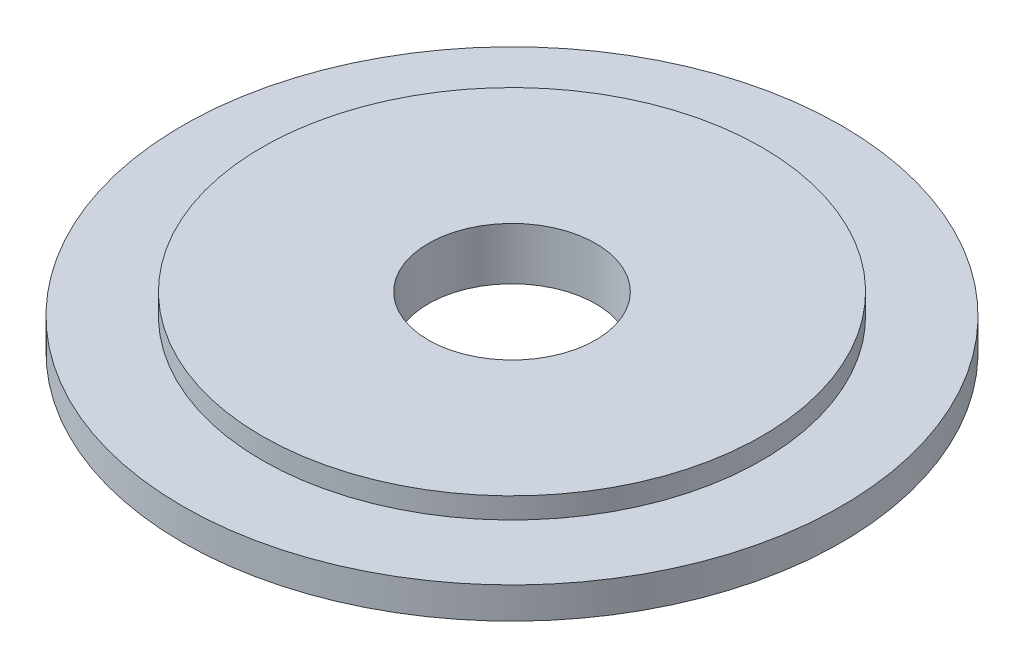
ISO-10303-21;
HEADER;
FILE_DESCRIPTION(('STEP AP214'),'2;1');
FILE_NAME('part.step','',(''),(''),'','','');
FILE_SCHEMA(('AUTOMOTIVE_DESIGN { 1 0 10303 214 1 1 1 1 }'));
ENDSEC;
DATA;
#1=APPLICATION_CONTEXT('core data for automotive mechanical design processes');
#2=APPLICATION_PROTOCOL_DEFINITION('international standard','automotive_design',2000,#1);
#3=PRODUCT_CONTEXT('',#1,'mechanical');
#4=PRODUCT('Part','Part','',(#3));
#5=PRODUCT_RELATED_PRODUCT_CATEGORY('part','',(#4));
#6=PRODUCT_DEFINITION_FORMATION('','',#4);
#7=PRODUCT_DEFINITION_CONTEXT('part definition',#1,'design');
#8=PRODUCT_DEFINITION('design','',#6,#7);
#9=PRODUCT_DEFINITION_SHAPE('','',#8);
#10=(LENGTH_UNIT() NAMED_UNIT(*) SI_UNIT(.MILLI.,.METRE.));
#11=(NAMED_UNIT(*) PLANE_ANGLE_UNIT() SI_UNIT($,.RADIAN.));
#12=(NAMED_UNIT(*) SI_UNIT($,.STERADIAN.) SOLID_ANGLE_UNIT());
#13=UNCERTAINTY_MEASURE_WITH_UNIT(LENGTH_MEASURE(1.E-05),#10,'distance_accuracy_value','');
#14=(GEOMETRIC_REPRESENTATION_CONTEXT(3) GLOBAL_UNCERTAINTY_ASSIGNED_CONTEXT((#13)) GLOBAL_UNIT_ASSIGNED_CONTEXT((#10,
#11,#12)) REPRESENTATION_CONTEXT('',''));
#15=CARTESIAN_POINT('',(0.,0.,0.));
#16=DIRECTION('',(0.,0.,1.));
#17=DIRECTION('',(1.,0.,0.));
#18=AXIS2_PLACEMENT_3D('',#15,#16,#17);
#19=CARTESIAN_POINT('',(0.,2.,0.));
#20=DIRECTION('',(0.,-1.,0.));
#21=DIRECTION('',(0.,0.,-1.));
#22=AXIS2_PLACEMENT_3D('',#19,#20,#21);
#23=CYLINDRICAL_SURFACE('',#22,8.);
#24=CARTESIAN_POINT('',(0.,2.,0.));
#25=DIRECTION('',(0.,1.,0.));
#26=DIRECTION('',(0.,0.,1.));
#27=AXIS2_PLACEMENT_3D('',#24,#25,#26);
#28=CIRCLE('',#27,8.);
#29=CARTESIAN_POINT('',(0.,2.,8.));
#30=VERTEX_POINT('',#29);
#31=EDGE_CURVE('E46',#30,#30,#28,.T.);
#32=ORIENTED_EDGE('',*,*,#31,.T.);
#33=EDGE_LOOP('',(#32));
#34=FACE_BOUND('',#33,.T.);
#35=CARTESIAN_POINT('',(0.,-3.,0.));
#36=DIRECTION('',(0.,1.,0.));
#37=DIRECTION('',(0.,0.,1.));
#38=AXIS2_PLACEMENT_3D('',#35,#36,#37);
#39=CIRCLE('',#38,8.);
#40=CARTESIAN_POINT('',(0.,-3.,8.));
#41=VERTEX_POINT('',#40);
#42=EDGE_CURVE('E56',#41,#41,#39,.T.);
#43=ORIENTED_EDGE('',*,*,#42,.F.);
#44=EDGE_LOOP('',(#43));
#45=FACE_BOUND('',#44,.T.);
#46=ADVANCED_FACE('F39',(#34,#45),#23,.F.);
#47=CARTESIAN_POINT('',(0.,2.,0.));
#48=DIRECTION('',(0.,-1.,0.));
#49=DIRECTION('',(0.,0.,-1.));
#50=AXIS2_PLACEMENT_3D('',#47,#48,#49);
#51=CYLINDRICAL_SURFACE('',#50,23.9);
#52=CARTESIAN_POINT('',(0.,2.,0.));
#53=DIRECTION('',(0.,1.,0.));
#54=DIRECTION('',(0.,0.,1.));
#55=AXIS2_PLACEMENT_3D('',#52,#53,#54);
#56=CIRCLE('',#55,23.9);
#57=CARTESIAN_POINT('',(0.,2.,23.9));
#58=VERTEX_POINT('',#57);
#59=EDGE_CURVE('E10',#58,#58,#56,.T.);
#60=ORIENTED_EDGE('',*,*,#59,.F.);
#61=EDGE_LOOP('',(#60));
#62=FACE_BOUND('',#61,.T.);
#63=CARTESIAN_POINT('',(0.,0.,0.));
#64=DIRECTION('',(0.,1.,0.));
#65=DIRECTION('',(0.,0.,1.));
#66=AXIS2_PLACEMENT_3D('',#63,#64,#65);
#67=CIRCLE('',#66,23.9);
#68=CARTESIAN_POINT('',(0.,0.,23.9));
#69=VERTEX_POINT('',#68);
#70=EDGE_CURVE('E42',#69,#69,#67,.T.);
#71=ORIENTED_EDGE('',*,*,#70,.T.);
#72=EDGE_LOOP('',(#71));
#73=FACE_BOUND('',#72,.T.);
#74=ADVANCED_FACE('F73',(#62,#73),#51,.T.);
#75=CARTESIAN_POINT('',(0.,2.,0.));
#76=DIRECTION('',(0.,1.,0.));
#77=DIRECTION('',(0.,0.,1.));
#78=AXIS2_PLACEMENT_3D('',#75,#76,#77);
#79=PLANE('',#78);
#80=ORIENTED_EDGE('',*,*,#31,.F.);
#81=EDGE_LOOP('',(#80));
#82=FACE_BOUND('',#81,.T.);
#83=ORIENTED_EDGE('',*,*,#59,.T.);
#84=EDGE_LOOP('',(#83));
#85=FACE_BOUND('',#84,.T.);
#86=ADVANCED_FACE('F80',(#82,#85),#79,.T.);
#87=CARTESIAN_POINT('',(0.,-3.,0.));
#88=DIRECTION('',(0.,1.,0.));
#89=DIRECTION('',(0.,0.,1.));
#90=AXIS2_PLACEMENT_3D('',#87,#88,#89);
#91=CYLINDRICAL_SURFACE('',#90,31.5);
#92=CARTESIAN_POINT('',(0.,-3.,0.));
#93=DIRECTION('',(0.,1.,0.));
#94=DIRECTION('',(0.,0.,1.));
#95=AXIS2_PLACEMENT_3D('',#92,#93,#94);
#96=CIRCLE('',#95,31.5);
#97=CARTESIAN_POINT('',(0.,-3.,31.5));
#98=VERTEX_POINT('',#97);
#99=EDGE_CURVE('E55',#98,#98,#96,.T.);
#100=ORIENTED_EDGE('',*,*,#99,.T.);
#101=EDGE_LOOP('',(#100));
#102=FACE_BOUND('',#101,.T.);
#103=CARTESIAN_POINT('',(0.,0.,0.));
#104=DIRECTION('',(0.,1.,0.));
#105=DIRECTION('',(0.,0.,1.));
#106=AXIS2_PLACEMENT_3D('',#103,#104,#105);
#107=CIRCLE('',#106,31.5);
#108=CARTESIAN_POINT('',(0.,0.,31.5));
#109=VERTEX_POINT('',#108);
#110=EDGE_CURVE('E52',#109,#109,#107,.T.);
#111=ORIENTED_EDGE('',*,*,#110,.F.);
#112=EDGE_LOOP('',(#111));
#113=FACE_BOUND('',#112,.T.);
#114=ADVANCED_FACE('F62',(#102,#113),#91,.T.);
#115=CARTESIAN_POINT('',(0.,-3.,0.));
#116=DIRECTION('',(0.,1.,0.));
#117=DIRECTION('',(0.,0.,1.));
#118=AXIS2_PLACEMENT_3D('',#115,#116,#117);
#119=PLANE('',#118);
#120=ORIENTED_EDGE('',*,*,#99,.F.);
#121=EDGE_LOOP('',(#120));
#122=FACE_BOUND('',#121,.T.);
#123=ORIENTED_EDGE('',*,*,#42,.T.);
#124=EDGE_LOOP('',(#123));
#125=FACE_BOUND('',#124,.T.);
#126=ADVANCED_FACE('F65',(#122,#125),#119,.F.);
#127=CARTESIAN_POINT('',(0.,0.,0.));
#128=DIRECTION('',(0.,1.,0.));
#129=DIRECTION('',(0.,0.,1.));
#130=AXIS2_PLACEMENT_3D('',#127,#128,#129);
#131=PLANE('',#130);
#132=ORIENTED_EDGE('',*,*,#70,.F.);
#133=EDGE_LOOP('',(#132));
#134=FACE_BOUND('',#133,.T.);
#135=ORIENTED_EDGE('',*,*,#110,.T.);
#136=EDGE_LOOP('',(#135));
#137=FACE_BOUND('',#136,.T.);
#138=ADVANCED_FACE('F68',(#134,#137),#131,.T.);
#139=CLOSED_SHELL('',(#46,#74,#86,#114,#126,#138));
#140=MANIFOLD_SOLID_BREP('B2',#139);
#141=ADVANCED_BREP_SHAPE_REPRESENTATION('',(#18,#140),#14);
#142=SHAPE_DEFINITION_REPRESENTATION(#9,#141);
ENDSEC;
END-ISO-10303-21;
